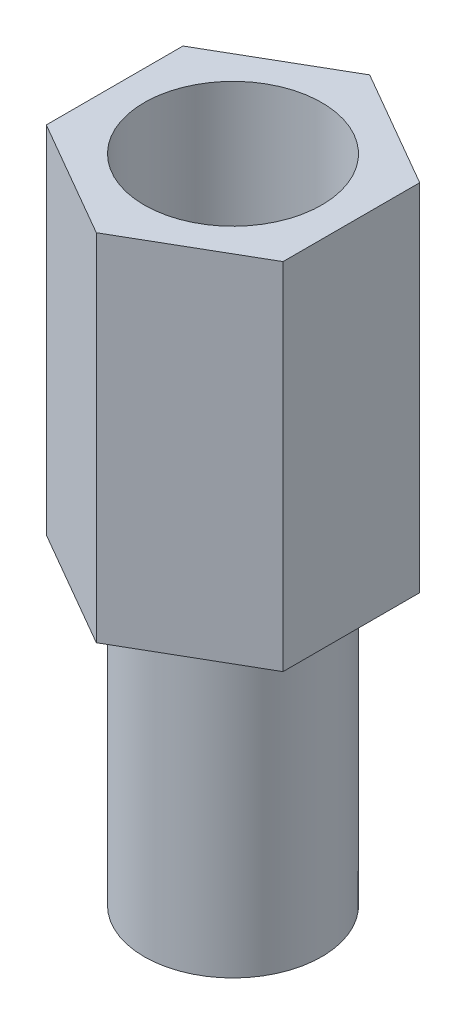
ISO-10303-21;
HEADER;
FILE_DESCRIPTION(('STEP AP214'),'2;1');
FILE_NAME('part.step','',(''),(''),'','','');
FILE_SCHEMA(('AUTOMOTIVE_DESIGN { 1 0 10303 214 1 1 1 1 }'));
ENDSEC;
DATA;
#1=APPLICATION_CONTEXT('core data for automotive mechanical design processes');
#2=APPLICATION_PROTOCOL_DEFINITION('international standard','automotive_design',2000,#1);
#3=PRODUCT_CONTEXT('',#1,'mechanical');
#4=PRODUCT('Part','Part','',(#3));
#5=PRODUCT_RELATED_PRODUCT_CATEGORY('part','',(#4));
#6=PRODUCT_DEFINITION_FORMATION('','',#4);
#7=PRODUCT_DEFINITION_CONTEXT('part definition',#1,'design');
#8=PRODUCT_DEFINITION('design','',#6,#7);
#9=PRODUCT_DEFINITION_SHAPE('','',#8);
#10=(LENGTH_UNIT() NAMED_UNIT(*) SI_UNIT(.MILLI.,.METRE.));
#11=(NAMED_UNIT(*) PLANE_ANGLE_UNIT() SI_UNIT($,.RADIAN.));
#12=(NAMED_UNIT(*) SI_UNIT($,.STERADIAN.) SOLID_ANGLE_UNIT());
#13=UNCERTAINTY_MEASURE_WITH_UNIT(LENGTH_MEASURE(1.E-05),#10,'distance_accuracy_value','');
#14=(GEOMETRIC_REPRESENTATION_CONTEXT(3) GLOBAL_UNCERTAINTY_ASSIGNED_CONTEXT((#13)) GLOBAL_UNIT_ASSIGNED_CONTEXT((#10,
#11,#12)) REPRESENTATION_CONTEXT('',''));
#15=CARTESIAN_POINT('',(0.,0.,0.));
#16=DIRECTION('',(0.,0.,1.));
#17=DIRECTION('',(1.,0.,0.));
#18=AXIS2_PLACEMENT_3D('',#15,#16,#17);
#19=CARTESIAN_POINT('',(0.,5.,0.));
#20=DIRECTION('',(0.,-1.,0.));
#21=DIRECTION('',(0.,0.,-1.));
#22=AXIS2_PLACEMENT_3D('',#19,#20,#21);
#23=CYLINDRICAL_SURFACE('',#22,1.5);
#24=CARTESIAN_POINT('',(0.,5.,0.));
#25=DIRECTION('',(0.,1.,0.));
#26=DIRECTION('',(0.,0.,1.));
#27=AXIS2_PLACEMENT_3D('',#24,#25,#26);
#28=CIRCLE('',#27,1.5);
#29=CARTESIAN_POINT('',(0.,5.,1.5));
#30=VERTEX_POINT('',#29);
#31=EDGE_CURVE('E11',#30,#30,#28,.T.);
#32=ORIENTED_EDGE('',*,*,#31,.F.);
#33=EDGE_LOOP('',(#32));
#34=FACE_BOUND('',#33,.T.);
#35=CARTESIAN_POINT('',(0.,0.,0.));
#36=DIRECTION('',(0.,1.,0.));
#37=DIRECTION('',(0.,0.,1.));
#38=AXIS2_PLACEMENT_3D('',#35,#36,#37);
#39=CIRCLE('',#38,1.5);
#40=CARTESIAN_POINT('',(0.,0.,1.5));
#41=VERTEX_POINT('',#40);
#42=EDGE_CURVE('E37',#41,#41,#39,.T.);
#43=ORIENTED_EDGE('',*,*,#42,.T.);
#44=EDGE_LOOP('',(#43));
#45=FACE_BOUND('',#44,.T.);
#46=ADVANCED_FACE('F34',(#34,#45),#23,.T.);
#47=CARTESIAN_POINT('',(0.,0.,0.));
#48=DIRECTION('',(0.,1.,0.));
#49=DIRECTION('',(0.,0.,1.));
#50=AXIS2_PLACEMENT_3D('',#47,#48,#49);
#51=PLANE('',#50);
#52=ORIENTED_EDGE('',*,*,#42,.F.);
#53=EDGE_LOOP('',(#52));
#54=FACE_BOUND('',#53,.T.);
#55=ADVANCED_FACE('F143',(#54),#51,.F.);
#56=CARTESIAN_POINT('',(2.,11.,-1.15470053837925));
#57=DIRECTION('',(-0.5,0.,0.866025403784439));
#58=DIRECTION('',(0.866025403784439,0.,0.5));
#59=AXIS2_PLACEMENT_3D('',#56,#57,#58);
#60=PLANE('',#59);
#61=DIRECTION('',(-0.866025403784438,0.,-0.5));
#62=VECTOR('',#61,1.);
#63=CARTESIAN_POINT('',(2.,5.,-1.15470053837925));
#64=LINE('',#63,#62);
#65=CARTESIAN_POINT('',(2.,5.,-1.15470053837925));
#66=VERTEX_POINT('',#65);
#67=CARTESIAN_POINT('',(0.,5.,-2.3094010767585));
#68=VERTEX_POINT('',#67);
#69=EDGE_CURVE('E119',#66,#68,#64,.T.);
#70=ORIENTED_EDGE('',*,*,#69,.T.);
#71=DIRECTION('',(0.,-1.,0.));
#72=VECTOR('',#71,1.);
#73=CARTESIAN_POINT('',(0.,11.,-2.3094010767585));
#74=LINE('',#73,#72);
#75=CARTESIAN_POINT('',(0.,11.,-2.3094010767585));
#76=VERTEX_POINT('',#75);
#77=EDGE_CURVE('E137',#76,#68,#74,.T.);
#78=ORIENTED_EDGE('',*,*,#77,.F.);
#79=DIRECTION('',(-0.866025403784438,0.,-0.5));
#80=VECTOR('',#79,1.);
#81=CARTESIAN_POINT('',(2.,11.,-1.15470053837925));
#82=LINE('',#81,#80);
#83=CARTESIAN_POINT('',(2.,11.,-1.15470053837925));
#84=VERTEX_POINT('',#83);
#85=EDGE_CURVE('E130',#84,#76,#82,.T.);
#86=ORIENTED_EDGE('',*,*,#85,.F.);
#87=DIRECTION('',(0.,-1.,0.));
#88=VECTOR('',#87,1.);
#89=CARTESIAN_POINT('',(2.,11.,-1.15470053837925));
#90=LINE('',#89,#88);
#91=EDGE_CURVE('E115',#84,#66,#90,.T.);
#92=ORIENTED_EDGE('',*,*,#91,.T.);
#93=EDGE_LOOP('',(#70,#78,#86,#92));
#94=FACE_BOUND('',#93,.T.);
#95=ADVANCED_FACE('F145',(#94),#60,.F.);
#96=CARTESIAN_POINT('',(0.,11.,-2.3094010767585));
#97=DIRECTION('',(0.5,0.,0.866025403784439));
#98=DIRECTION('',(0.866025403784439,0.,-0.5));
#99=AXIS2_PLACEMENT_3D('',#96,#97,#98);
#100=PLANE('',#99);
#101=DIRECTION('',(-0.866025403784439,0.,0.5));
#102=VECTOR('',#101,1.);
#103=CARTESIAN_POINT('',(0.,5.,-2.3094010767585));
#104=LINE('',#103,#102);
#105=CARTESIAN_POINT('',(-2.,5.,-1.15470053837925));
#106=VERTEX_POINT('',#105);
#107=EDGE_CURVE('E122',#68,#106,#104,.T.);
#108=ORIENTED_EDGE('',*,*,#107,.T.);
#109=DIRECTION('',(0.,-1.,0.));
#110=VECTOR('',#109,1.);
#111=CARTESIAN_POINT('',(-2.,11.,-1.15470053837925));
#112=LINE('',#111,#110);
#113=CARTESIAN_POINT('',(-2.,11.,-1.15470053837925));
#114=VERTEX_POINT('',#113);
#115=EDGE_CURVE('E134',#114,#106,#112,.T.);
#116=ORIENTED_EDGE('',*,*,#115,.F.);
#117=DIRECTION('',(-0.866025403784439,0.,0.5));
#118=VECTOR('',#117,1.);
#119=CARTESIAN_POINT('',(0.,11.,-2.3094010767585));
#120=LINE('',#119,#118);
#121=EDGE_CURVE('E88',#76,#114,#120,.T.);
#122=ORIENTED_EDGE('',*,*,#121,.F.);
#123=ORIENTED_EDGE('',*,*,#77,.T.);
#124=EDGE_LOOP('',(#108,#116,#122,#123));
#125=FACE_BOUND('',#124,.T.);
#126=ADVANCED_FACE('F150',(#125),#100,.F.);
#127=CARTESIAN_POINT('',(-2.,11.,-1.15470053837925));
#128=DIRECTION('',(1.,0.,0.));
#129=DIRECTION('',(0.,0.,-1.));
#130=AXIS2_PLACEMENT_3D('',#127,#128,#129);
#131=PLANE('',#130);
#132=DIRECTION('',(0.,0.,1.));
#133=VECTOR('',#132,1.);
#134=CARTESIAN_POINT('',(-2.,5.,-1.15470053837925));
#135=LINE('',#134,#133);
#136=CARTESIAN_POINT('',(-2.,5.,1.15470053837925));
#137=VERTEX_POINT('',#136);
#138=EDGE_CURVE('E125',#106,#137,#135,.T.);
#139=ORIENTED_EDGE('',*,*,#138,.T.);
#140=DIRECTION('',(0.,-1.,0.));
#141=VECTOR('',#140,1.);
#142=CARTESIAN_POINT('',(-2.,11.,1.15470053837925));
#143=LINE('',#142,#141);
#144=CARTESIAN_POINT('',(-2.,11.,1.15470053837925));
#145=VERTEX_POINT('',#144);
#146=EDGE_CURVE('E110',#145,#137,#143,.T.);
#147=ORIENTED_EDGE('',*,*,#146,.F.);
#148=DIRECTION('',(0.,0.,1.));
#149=VECTOR('',#148,1.);
#150=CARTESIAN_POINT('',(-2.,11.,-1.15470053837925));
#151=LINE('',#150,#149);
#152=EDGE_CURVE('E101',#114,#145,#151,.T.);
#153=ORIENTED_EDGE('',*,*,#152,.F.);
#154=ORIENTED_EDGE('',*,*,#115,.T.);
#155=EDGE_LOOP('',(#139,#147,#153,#154));
#156=FACE_BOUND('',#155,.T.);
#157=ADVANCED_FACE('F157',(#156),#131,.F.);
#158=CARTESIAN_POINT('',(-2.,11.,1.15470053837925));
#159=DIRECTION('',(0.5,0.,-0.866025403784438));
#160=DIRECTION('',(-0.866025403784439,0.,-0.5));
#161=AXIS2_PLACEMENT_3D('',#158,#159,#160);
#162=PLANE('',#161);
#163=DIRECTION('',(0.866025403784438,0.,0.5));
#164=VECTOR('',#163,1.);
#165=CARTESIAN_POINT('',(-2.,5.,1.15470053837925));
#166=LINE('',#165,#164);
#167=CARTESIAN_POINT('',(0.,5.,2.3094010767585));
#168=VERTEX_POINT('',#167);
#169=EDGE_CURVE('E109',#137,#168,#166,.T.);
#170=ORIENTED_EDGE('',*,*,#169,.T.);
#171=DIRECTION('',(0.,-1.,0.));
#172=VECTOR('',#171,1.);
#173=CARTESIAN_POINT('',(0.,11.,2.3094010767585));
#174=LINE('',#173,#172);
#175=CARTESIAN_POINT('',(0.,11.,2.3094010767585));
#176=VERTEX_POINT('',#175);
#177=EDGE_CURVE('E106',#176,#168,#174,.T.);
#178=ORIENTED_EDGE('',*,*,#177,.F.);
#179=DIRECTION('',(0.866025403784438,0.,0.5));
#180=VECTOR('',#179,1.);
#181=CARTESIAN_POINT('',(-2.,11.,1.15470053837925));
#182=LINE('',#181,#180);
#183=EDGE_CURVE('E95',#145,#176,#182,.T.);
#184=ORIENTED_EDGE('',*,*,#183,.F.);
#185=ORIENTED_EDGE('',*,*,#146,.T.);
#186=EDGE_LOOP('',(#170,#178,#184,#185));
#187=FACE_BOUND('',#186,.T.);
#188=ADVANCED_FACE('F107',(#187),#162,.F.);
#189=CARTESIAN_POINT('',(0.,11.,2.3094010767585));
#190=DIRECTION('',(-0.5,0.,-0.866025403784438));
#191=DIRECTION('',(-0.866025403784439,0.,0.5));
#192=AXIS2_PLACEMENT_3D('',#189,#190,#191);
#193=PLANE('',#192);
#194=DIRECTION('',(0.866025403784439,0.,-0.5));
#195=VECTOR('',#194,1.);
#196=CARTESIAN_POINT('',(0.,5.,2.3094010767585));
#197=LINE('',#196,#195);
#198=CARTESIAN_POINT('',(2.,5.,1.15470053837925));
#199=VERTEX_POINT('',#198);
#200=EDGE_CURVE('E73',#168,#199,#197,.T.);
#201=ORIENTED_EDGE('',*,*,#200,.T.);
#202=DIRECTION('',(0.,-1.,0.));
#203=VECTOR('',#202,1.);
#204=CARTESIAN_POINT('',(2.,11.,1.15470053837925));
#205=LINE('',#204,#203);
#206=CARTESIAN_POINT('',(2.,11.,1.15470053837925));
#207=VERTEX_POINT('',#206);
#208=EDGE_CURVE('E111',#207,#199,#205,.T.);
#209=ORIENTED_EDGE('',*,*,#208,.F.);
#210=DIRECTION('',(0.866025403784439,0.,-0.5));
#211=VECTOR('',#210,1.);
#212=CARTESIAN_POINT('',(0.,11.,2.3094010767585));
#213=LINE('',#212,#211);
#214=EDGE_CURVE('E99',#176,#207,#213,.T.);
#215=ORIENTED_EDGE('',*,*,#214,.F.);
#216=ORIENTED_EDGE('',*,*,#177,.T.);
#217=EDGE_LOOP('',(#201,#209,#215,#216));
#218=FACE_BOUND('',#217,.T.);
#219=ADVANCED_FACE('F113',(#218),#193,.F.);
#220=CARTESIAN_POINT('',(2.,11.,1.15470053837925));
#221=DIRECTION('',(-1.,0.,0.));
#222=DIRECTION('',(0.,0.,1.));
#223=AXIS2_PLACEMENT_3D('',#220,#221,#222);
#224=PLANE('',#223);
#225=DIRECTION('',(0.,0.,-1.));
#226=VECTOR('',#225,1.);
#227=CARTESIAN_POINT('',(2.,5.,1.15470053837925));
#228=LINE('',#227,#226);
#229=EDGE_CURVE('E79',#199,#66,#228,.T.);
#230=ORIENTED_EDGE('',*,*,#229,.T.);
#231=ORIENTED_EDGE('',*,*,#91,.F.);
#232=DIRECTION('',(0.,0.,-1.));
#233=VECTOR('',#232,1.);
#234=CARTESIAN_POINT('',(2.,11.,1.15470053837925));
#235=LINE('',#234,#233);
#236=EDGE_CURVE('E50',#207,#84,#235,.T.);
#237=ORIENTED_EDGE('',*,*,#236,.F.);
#238=ORIENTED_EDGE('',*,*,#208,.T.);
#239=EDGE_LOOP('',(#230,#231,#237,#238));
#240=FACE_BOUND('',#239,.T.);
#241=ADVANCED_FACE('F165',(#240),#224,.F.);
#242=CARTESIAN_POINT('',(0.,11.,0.));
#243=DIRECTION('',(0.,1.,0.));
#244=DIRECTION('',(0.,0.,1.));
#245=AXIS2_PLACEMENT_3D('',#242,#243,#244);
#246=PLANE('',#245);
#247=CARTESIAN_POINT('',(0.,11.,0.));
#248=DIRECTION('',(0.,1.,0.));
#249=DIRECTION('',(0.,0.,1.));
#250=AXIS2_PLACEMENT_3D('',#247,#248,#249);
#251=CIRCLE('',#250,1.5);
#252=CARTESIAN_POINT('',(0.,11.,1.5));
#253=VERTEX_POINT('',#252);
#254=EDGE_CURVE('E186',#253,#253,#251,.T.);
#255=ORIENTED_EDGE('',*,*,#254,.F.);
#256=EDGE_LOOP('',(#255));
#257=FACE_BOUND('',#256,.T.);
#258=ORIENTED_EDGE('',*,*,#85,.T.);
#259=ORIENTED_EDGE('',*,*,#121,.T.);
#260=ORIENTED_EDGE('',*,*,#152,.T.);
#261=ORIENTED_EDGE('',*,*,#183,.T.);
#262=ORIENTED_EDGE('',*,*,#214,.T.);
#263=ORIENTED_EDGE('',*,*,#236,.T.);
#264=EDGE_LOOP('',(#258,#259,#260,#261,#262,#263));
#265=FACE_BOUND('',#264,.T.);
#266=ADVANCED_FACE('F97',(#257,#265),#246,.T.);
#267=CARTESIAN_POINT('',(0.,5.,0.));
#268=DIRECTION('',(0.,1.,0.));
#269=DIRECTION('',(0.,0.,1.));
#270=AXIS2_PLACEMENT_3D('',#267,#268,#269);
#271=PLANE('',#270);
#272=ORIENTED_EDGE('',*,*,#31,.T.);
#273=EDGE_LOOP('',(#272));
#274=FACE_BOUND('',#273,.T.);
#275=ORIENTED_EDGE('',*,*,#69,.F.);
#276=ORIENTED_EDGE('',*,*,#229,.F.);
#277=ORIENTED_EDGE('',*,*,#200,.F.);
#278=ORIENTED_EDGE('',*,*,#169,.F.);
#279=ORIENTED_EDGE('',*,*,#138,.F.);
#280=ORIENTED_EDGE('',*,*,#107,.F.);
#281=EDGE_LOOP('',(#275,#276,#277,#278,#279,#280));
#282=FACE_BOUND('',#281,.T.);
#283=ADVANCED_FACE('F168',(#274,#282),#271,.F.);
#284=CARTESIAN_POINT('',(0.,6.,0.));
#285=DIRECTION('',(0.,1.,0.));
#286=DIRECTION('',(0.,0.,1.));
#287=AXIS2_PLACEMENT_3D('',#284,#285,#286);
#288=CYLINDRICAL_SURFACE('',#287,1.5);
#289=CARTESIAN_POINT('',(0.,6.,0.));
#290=DIRECTION('',(0.,1.,0.));
#291=DIRECTION('',(0.,0.,1.));
#292=AXIS2_PLACEMENT_3D('',#289,#290,#291);
#293=CIRCLE('',#292,1.5);
#294=CARTESIAN_POINT('',(0.,6.,1.5));
#295=VERTEX_POINT('',#294);
#296=EDGE_CURVE('E123',#295,#295,#293,.T.);
#297=ORIENTED_EDGE('',*,*,#296,.F.);
#298=EDGE_LOOP('',(#297));
#299=FACE_BOUND('',#298,.T.);
#300=ORIENTED_EDGE('',*,*,#254,.T.);
#301=EDGE_LOOP('',(#300));
#302=FACE_BOUND('',#301,.T.);
#303=ADVANCED_FACE('F171',(#299,#302),#288,.F.);
#304=CARTESIAN_POINT('',(0.,6.,0.));
#305=DIRECTION('',(0.,1.,0.));
#306=DIRECTION('',(0.,0.,1.));
#307=AXIS2_PLACEMENT_3D('',#304,#305,#306);
#308=PLANE('',#307);
#309=ORIENTED_EDGE('',*,*,#296,.T.);
#310=EDGE_LOOP('',(#309));
#311=FACE_BOUND('',#310,.T.);
#312=ADVANCED_FACE('F178',(#311),#308,.T.);
#313=CLOSED_SHELL('',(#46,#55,#95,#126,#157,#188,#219,#241,#266,#283,#303,#312));
#314=MANIFOLD_SOLID_BREP('B2',#313);
#315=ADVANCED_BREP_SHAPE_REPRESENTATION('',(#18,#314),#14);
#316=SHAPE_DEFINITION_REPRESENTATION(#9,#315);
ENDSEC;
END-ISO-10303-21;
